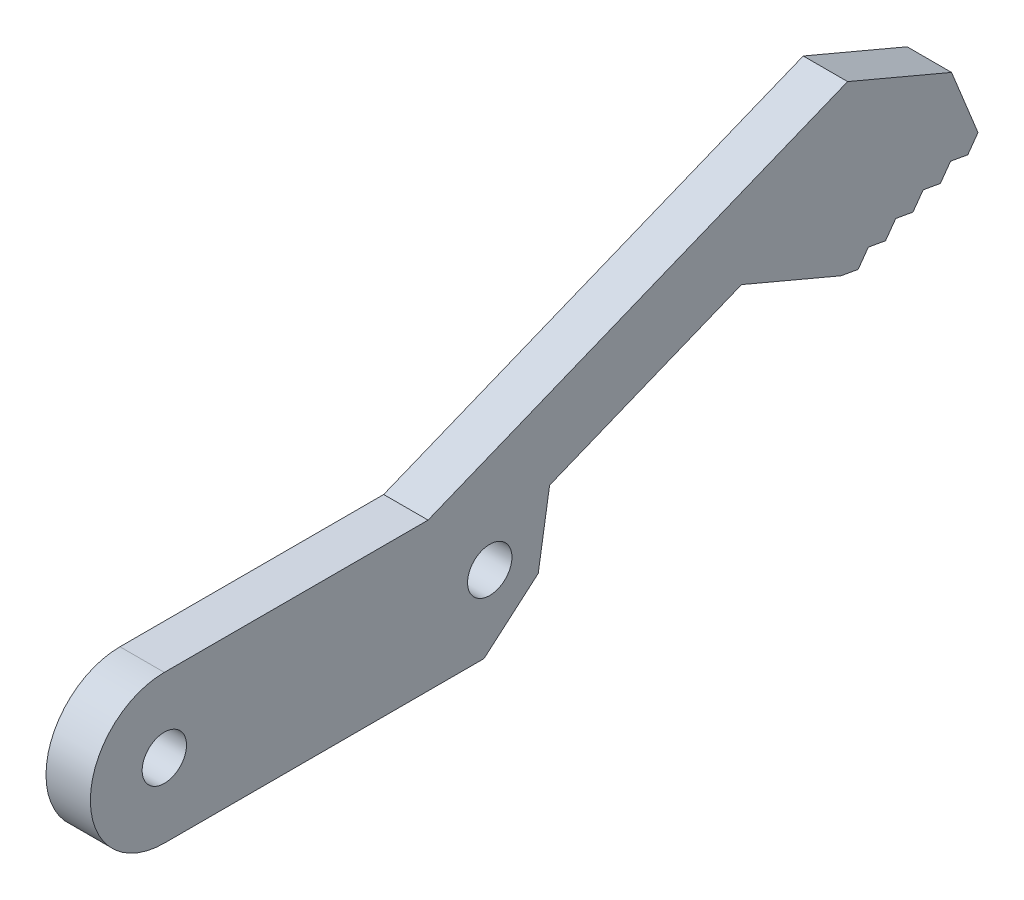
ISO-10303-21;
HEADER;
FILE_DESCRIPTION(('STEP AP214'),'2;1');
FILE_NAME('part.step','',(''),(''),'','','');
FILE_SCHEMA(('AUTOMOTIVE_DESIGN { 1 0 10303 214 1 1 1 1 }'));
ENDSEC;
DATA;
#1=APPLICATION_CONTEXT('core data for automotive mechanical design processes');
#2=APPLICATION_PROTOCOL_DEFINITION('international standard','automotive_design',2000,#1);
#3=PRODUCT_CONTEXT('',#1,'mechanical');
#4=PRODUCT('Part','Part','',(#3));
#5=PRODUCT_RELATED_PRODUCT_CATEGORY('part','',(#4));
#6=PRODUCT_DEFINITION_FORMATION('','',#4);
#7=PRODUCT_DEFINITION_CONTEXT('part definition',#1,'design');
#8=PRODUCT_DEFINITION('design','',#6,#7);
#9=PRODUCT_DEFINITION_SHAPE('','',#8);
#10=(LENGTH_UNIT() NAMED_UNIT(*) SI_UNIT(.MILLI.,.METRE.));
#11=(NAMED_UNIT(*) PLANE_ANGLE_UNIT() SI_UNIT($,.RADIAN.));
#12=(NAMED_UNIT(*) SI_UNIT($,.STERADIAN.) SOLID_ANGLE_UNIT());
#13=UNCERTAINTY_MEASURE_WITH_UNIT(LENGTH_MEASURE(1.E-05),#10,'distance_accuracy_value','');
#14=(GEOMETRIC_REPRESENTATION_CONTEXT(3) GLOBAL_UNCERTAINTY_ASSIGNED_CONTEXT((#13)) GLOBAL_UNIT_ASSIGNED_CONTEXT((#10,
#11,#12)) REPRESENTATION_CONTEXT('',''));
#15=CARTESIAN_POINT('',(0.,0.,0.));
#16=DIRECTION('',(0.,0.,1.));
#17=DIRECTION('',(1.,0.,0.));
#18=AXIS2_PLACEMENT_3D('',#15,#16,#17);
#19=CARTESIAN_POINT('',(1.5,0.,0.));
#20=DIRECTION('',(1.,0.,0.));
#21=DIRECTION('',(0.,0.,-1.));
#22=AXIS2_PLACEMENT_3D('',#19,#20,#21);
#23=PLANE('',#22);
#24=CARTESIAN_POINT('',(1.5,0.,-11.));
#25=DIRECTION('',(1.,0.,0.));
#26=DIRECTION('',(0.,0.,-1.));
#27=AXIS2_PLACEMENT_3D('',#24,#25,#26);
#28=CIRCLE('',#27,1.5);
#29=CARTESIAN_POINT('',(1.5,0.,-12.5));
#30=VERTEX_POINT('',#29);
#31=EDGE_CURVE('E116',#30,#30,#28,.T.);
#32=ORIENTED_EDGE('',*,*,#31,.F.);
#33=EDGE_LOOP('',(#32));
#34=FACE_BOUND('',#33,.T.);
#35=CARTESIAN_POINT('',(1.5,0.,11.));
#36=DIRECTION('',(1.,0.,0.));
#37=DIRECTION('',(0.,0.,-1.));
#38=AXIS2_PLACEMENT_3D('',#35,#36,#37);
#39=CIRCLE('',#38,1.5);
#40=CARTESIAN_POINT('',(1.5,0.,9.50000000000001));
#41=VERTEX_POINT('',#40);
#42=EDGE_CURVE('E87',#41,#41,#39,.T.);
#43=ORIENTED_EDGE('',*,*,#42,.F.);
#44=EDGE_LOOP('',(#43));
#45=FACE_BOUND('',#44,.T.);
#46=DIRECTION('',(0.,0.811746559900306,-0.584009865062243));
#47=VECTOR('',#46,1.);
#48=CARTESIAN_POINT('',(1.5,-17.1372740545539,-23.8200141676892));
#49=LINE('',#48,#47);
#50=CARTESIAN_POINT('',(1.5,7.39191676895877,-41.4675043211245));
#51=VERTEX_POINT('',#50);
#52=CARTESIAN_POINT('',(1.5,8.35132428291398,-42.1577486417576));
#53=VERTEX_POINT('',#52);
#54=EDGE_CURVE('E274',#51,#53,#49,.T.);
#55=ORIENTED_EDGE('',*,*,#54,.T.);
#56=DIRECTION('',(0.,-0.176310458660285,-0.984334608843456));
#57=VECTOR('',#56,1.);
#58=CARTESIAN_POINT('',(1.5,15.4081336773122,-2.7598492335221));
#59=LINE('',#58,#57);
#60=CARTESIAN_POINT('',(1.5,8.14294202768355,-43.3211388753874));
#61=VERTEX_POINT('',#60);
#62=EDGE_CURVE('E278',#53,#61,#59,.T.);
#63=ORIENTED_EDGE('',*,*,#62,.T.);
#64=DIRECTION('',(0.,0.811746559900309,-0.584009865062239));
#65=VECTOR('',#64,1.);
#66=CARTESIAN_POINT('',(1.5,-17.7598725540869,-24.6853971353918));
#67=LINE('',#66,#65);
#68=CARTESIAN_POINT('',(1.5,9.10234954163876,-44.0113831960205));
#69=VERTEX_POINT('',#68);
#70=EDGE_CURVE('E227',#61,#69,#67,.T.);
#71=ORIENTED_EDGE('',*,*,#70,.T.);
#72=DIRECTION('',(0.,0.926817277131445,0.375512629362388));
#73=VECTOR('',#72,1.);
#74=CARTESIAN_POINT('',(1.5,16.6008716845223,-40.9732549309526));
#75=LINE('',#74,#73);
#76=CARTESIAN_POINT('',(1.5,13.5184546570459,-42.2221381265287));
#77=VERTEX_POINT('',#76);
#78=EDGE_CURVE('E50',#69,#77,#75,.T.);
#79=ORIENTED_EDGE('',*,*,#78,.T.);
#80=DIRECTION('',(0.,-0.389831254937157,-0.920886308223834));
#81=VECTOR('',#80,1.);
#82=CARTESIAN_POINT('',(1.5,16.4926366310558,-35.1963201005385));
#83=LINE('',#82,#81);
#84=CARTESIAN_POINT('',(1.5,16.4926366310558,-35.1963201005385));
#85=VERTEX_POINT('',#84);
#86=EDGE_CURVE('E178',#85,#77,#83,.T.);
#87=ORIENTED_EDGE('',*,*,#86,.F.);
#88=DIRECTION('',(0.,0.375512629362387,-0.926817277131445));
#89=VECTOR('',#88,1.);
#90=CARTESIAN_POINT('',(1.5,1.91758297252369,0.776934830414033));
#91=LINE('',#90,#89);
#92=CARTESIAN_POINT('',(1.5,5.,-6.83089812380655));
#93=VERTEX_POINT('',#92);
#94=EDGE_CURVE('E161',#93,#85,#91,.T.);
#95=ORIENTED_EDGE('',*,*,#94,.F.);
#96=DIRECTION('',(0.,0.,-1.));
#97=VECTOR('',#96,1.);
#98=CARTESIAN_POINT('',(1.5,4.99999999999999,0.));
#99=LINE('',#98,#97);
#100=CARTESIAN_POINT('',(1.5,5.,11.));
#101=VERTEX_POINT('',#100);
#102=EDGE_CURVE('E102',#101,#93,#99,.T.);
#103=ORIENTED_EDGE('',*,*,#102,.F.);
#104=CARTESIAN_POINT('',(1.5,0.,11.));
#105=DIRECTION('',(1.,0.,0.));
#106=DIRECTION('',(0.,0.,-1.));
#107=AXIS2_PLACEMENT_3D('',#104,#105,#106);
#108=CIRCLE('',#107,5.);
#109=CARTESIAN_POINT('',(1.5,-5.,11.));
#110=VERTEX_POINT('',#109);
#111=EDGE_CURVE('E58',#101,#110,#108,.T.);
#112=ORIENTED_EDGE('',*,*,#111,.T.);
#113=DIRECTION('',(0.,0.,-1.));
#114=VECTOR('',#113,1.);
#115=CARTESIAN_POINT('',(1.5,-5.,0.));
#116=LINE('',#115,#114);
#117=CARTESIAN_POINT('',(1.5,-5.,-10.6103174919287));
#118=VERTEX_POINT('',#117);
#119=EDGE_CURVE('E86',#110,#118,#116,.T.);
#120=ORIENTED_EDGE('',*,*,#119,.T.);
#121=DIRECTION('',(0.,-0.652055247286905,0.758171454544164));
#122=VECTOR('',#121,1.);
#123=CARTESIAN_POINT('',(1.5,-8.11953898551642,-6.9831012092637));
#124=LINE('',#123,#122);
#125=CARTESIAN_POINT('',(1.5,-1.84405260313138,-14.2798673319224));
#126=VERTEX_POINT('',#125);
#127=EDGE_CURVE('E228',#126,#118,#124,.T.);
#128=ORIENTED_EDGE('',*,*,#127,.F.);
#129=DIRECTION('',(0.,-0.987317731643147,0.158756722008964));
#130=VECTOR('',#129,1.);
#131=CARTESIAN_POINT('',(1.5,-2.2847508524873,-14.209004825132));
#132=LINE('',#131,#130);
#133=CARTESIAN_POINT('',(1.5,2.93456521802145,-15.0482498664458));
#134=VERTEX_POINT('',#133);
#135=EDGE_CURVE('E232',#134,#126,#132,.T.);
#136=ORIENTED_EDGE('',*,*,#135,.F.);
#137=DIRECTION('',(0.,0.375512629362387,-0.926817277131445));
#138=VECTOR('',#137,1.);
#139=CARTESIAN_POINT('',(1.5,-2.71650341313353,-1.1006283163979));
#140=LINE('',#139,#138);
#141=CARTESIAN_POINT('',(1.5,8.19174202909487,-28.0236917462861));
#142=VERTEX_POINT('',#141);
#143=EDGE_CURVE('E136',#134,#142,#140,.T.);
#144=ORIENTED_EDGE('',*,*,#143,.T.);
#145=DIRECTION('',(0.,0.389831254937156,0.920886308223834));
#146=VECTOR('',#145,1.);
#147=CARTESIAN_POINT('',(1.5,17.0070885712925,-7.19947144546189));
#148=LINE('',#147,#146);
#149=CARTESIAN_POINT('',(1.5,5.34722324801488,-34.743210424706));
#150=VERTEX_POINT('',#149);
#151=EDGE_CURVE('E158',#150,#142,#148,.T.);
#152=ORIENTED_EDGE('',*,*,#151,.F.);
#153=DIRECTION('',(0.,-0.176310458660285,-0.984334608843456));
#154=VECTOR('',#153,1.);
#155=CARTESIAN_POINT('',(1.5,11.2106343735009,-2.00800832410744));
#156=LINE('',#155,#154);
#157=CARTESIAN_POINT('',(1.5,5.13884099278445,-35.9066006583358));
#158=VERTEX_POINT('',#157);
#159=EDGE_CURVE('E251',#150,#158,#156,.T.);
#160=ORIENTED_EDGE('',*,*,#159,.T.);
#161=DIRECTION('',(0.,0.811746559900309,-0.584009865062239));
#162=VECTOR('',#161,1.);
#163=CARTESIAN_POINT('',(1.5,-15.2694785559546,-21.223865264582));
#164=LINE('',#163,#162);
#165=CARTESIAN_POINT('',(1.5,6.09824850673965,-36.5968449789689));
#166=VERTEX_POINT('',#165);
#167=EDGE_CURVE('E212',#158,#166,#164,.T.);
#168=ORIENTED_EDGE('',*,*,#167,.T.);
#169=DIRECTION('',(0.,-0.176310458660285,-0.984334608843456));
#170=VECTOR('',#169,1.);
#171=CARTESIAN_POINT('',(1.5,12.2600091994537,-2.1959685514611));
#172=LINE('',#171,#170);
#173=CARTESIAN_POINT('',(1.5,5.88986625150922,-37.7602352125987));
#174=VERTEX_POINT('',#173);
#175=EDGE_CURVE('E190',#166,#174,#172,.T.);
#176=ORIENTED_EDGE('',*,*,#175,.T.);
#177=DIRECTION('',(0.,0.811746559900306,-0.584009865062243));
#178=VECTOR('',#177,1.);
#179=CARTESIAN_POINT('',(1.5,-15.8920770554877,-22.0892482322843));
#180=LINE('',#179,#178);
#181=CARTESIAN_POINT('',(1.5,6.84927376546443,-38.4504795332318));
#182=VERTEX_POINT('',#181);
#183=EDGE_CURVE('E252',#174,#182,#180,.T.);
#184=ORIENTED_EDGE('',*,*,#183,.T.);
#185=DIRECTION('',(0.,-0.176310458660286,-0.984334608843456));
#186=VECTOR('',#185,1.);
#187=CARTESIAN_POINT('',(1.5,13.3093840254066,-2.38392877881479));
#188=LINE('',#187,#186);
#189=CARTESIAN_POINT('',(1.5,6.640891510234,-39.6138697668616));
#190=VERTEX_POINT('',#189);
#191=EDGE_CURVE('E256',#182,#190,#188,.T.);
#192=ORIENTED_EDGE('',*,*,#191,.T.);
#193=DIRECTION('',(0.,0.811746559900306,-0.584009865062243));
#194=VECTOR('',#193,1.);
#195=CARTESIAN_POINT('',(1.5,-16.5146755550208,-22.9546311999867));
#196=LINE('',#195,#194);
#197=CARTESIAN_POINT('',(1.5,7.6002990241892,-40.3041140874947));
#198=VERTEX_POINT('',#197);
#199=EDGE_CURVE('E191',#190,#198,#196,.T.);
#200=ORIENTED_EDGE('',*,*,#199,.T.);
#201=DIRECTION('',(0.,-0.176310458660286,-0.984334608843456));
#202=VECTOR('',#201,1.);
#203=CARTESIAN_POINT('',(1.5,14.3587588513594,-2.57188900616846));
#204=LINE('',#203,#202);
#205=EDGE_CURVE('E195',#198,#51,#204,.T.);
#206=ORIENTED_EDGE('',*,*,#205,.T.);
#207=EDGE_LOOP('',(#55,#63,#71,#79,#87,#95,#103,#112,#120,#128,#136,#144,#152,#160,#168,#176,
#184,#192,#200,#206));
#208=FACE_BOUND('',#207,.T.);
#209=ADVANCED_FACE('F35',(#34,#45,#208),#23,.T.);
#210=CARTESIAN_POINT('',(-1.5,0.,0.));
#211=DIRECTION('',(1.,0.,0.));
#212=DIRECTION('',(0.,0.,-1.));
#213=AXIS2_PLACEMENT_3D('',#210,#211,#212);
#214=PLANE('',#213);
#215=CARTESIAN_POINT('',(-1.5,0.,-11.));
#216=DIRECTION('',(1.,0.,0.));
#217=DIRECTION('',(0.,0.,-1.));
#218=AXIS2_PLACEMENT_3D('',#215,#216,#217);
#219=CIRCLE('',#218,1.5);
#220=CARTESIAN_POINT('',(-1.5,0.,-12.5));
#221=VERTEX_POINT('',#220);
#222=EDGE_CURVE('E94',#221,#221,#219,.T.);
#223=ORIENTED_EDGE('',*,*,#222,.T.);
#224=EDGE_LOOP('',(#223));
#225=FACE_BOUND('',#224,.T.);
#226=CARTESIAN_POINT('',(-1.5,0.,11.));
#227=DIRECTION('',(1.,0.,0.));
#228=DIRECTION('',(0.,0.,-1.));
#229=AXIS2_PLACEMENT_3D('',#226,#227,#228);
#230=CIRCLE('',#229,1.5);
#231=CARTESIAN_POINT('',(-1.5,0.,9.50000000000001));
#232=VERTEX_POINT('',#231);
#233=EDGE_CURVE('E97',#232,#232,#230,.T.);
#234=ORIENTED_EDGE('',*,*,#233,.T.);
#235=EDGE_LOOP('',(#234));
#236=FACE_BOUND('',#235,.T.);
#237=DIRECTION('',(0.,-0.176310458660285,-0.984334608843456));
#238=VECTOR('',#237,1.);
#239=CARTESIAN_POINT('',(-1.5,15.4081336773122,-2.7598492335221));
#240=LINE('',#239,#238);
#241=CARTESIAN_POINT('',(-1.5,8.35132428291398,-42.1577486417576));
#242=VERTEX_POINT('',#241);
#243=CARTESIAN_POINT('',(-1.5,8.14294202768355,-43.3211388753874));
#244=VERTEX_POINT('',#243);
#245=EDGE_CURVE('E277',#242,#244,#240,.T.);
#246=ORIENTED_EDGE('',*,*,#245,.F.);
#247=DIRECTION('',(0.,0.811746559900306,-0.584009865062243));
#248=VECTOR('',#247,1.);
#249=CARTESIAN_POINT('',(-1.5,-17.1372740545539,-23.8200141676892));
#250=LINE('',#249,#248);
#251=CARTESIAN_POINT('',(-1.5,7.39191676895877,-41.4675043211245));
#252=VERTEX_POINT('',#251);
#253=EDGE_CURVE('E271',#252,#242,#250,.T.);
#254=ORIENTED_EDGE('',*,*,#253,.F.);
#255=DIRECTION('',(0.,-0.176310458660286,-0.984334608843456));
#256=VECTOR('',#255,1.);
#257=CARTESIAN_POINT('',(-1.5,14.3587588513594,-2.57188900616846));
#258=LINE('',#257,#256);
#259=CARTESIAN_POINT('',(-1.5,7.6002990241892,-40.3041140874947));
#260=VERTEX_POINT('',#259);
#261=EDGE_CURVE('E194',#260,#252,#258,.T.);
#262=ORIENTED_EDGE('',*,*,#261,.F.);
#263=DIRECTION('',(0.,0.811746559900306,-0.584009865062243));
#264=VECTOR('',#263,1.);
#265=CARTESIAN_POINT('',(-1.5,-16.5146755550208,-22.9546311999867));
#266=LINE('',#265,#264);
#267=CARTESIAN_POINT('',(-1.5,6.640891510234,-39.6138697668616));
#268=VERTEX_POINT('',#267);
#269=EDGE_CURVE('E187',#268,#260,#266,.T.);
#270=ORIENTED_EDGE('',*,*,#269,.F.);
#271=DIRECTION('',(0.,-0.176310458660286,-0.984334608843456));
#272=VECTOR('',#271,1.);
#273=CARTESIAN_POINT('',(-1.5,13.3093840254066,-2.38392877881479));
#274=LINE('',#273,#272);
#275=CARTESIAN_POINT('',(-1.5,6.84927376546443,-38.4504795332318));
#276=VERTEX_POINT('',#275);
#277=EDGE_CURVE('E255',#276,#268,#274,.T.);
#278=ORIENTED_EDGE('',*,*,#277,.F.);
#279=DIRECTION('',(0.,0.811746559900306,-0.584009865062243));
#280=VECTOR('',#279,1.);
#281=CARTESIAN_POINT('',(-1.5,-15.8920770554877,-22.0892482322843));
#282=LINE('',#281,#280);
#283=CARTESIAN_POINT('',(-1.5,5.88986625150922,-37.7602352125987));
#284=VERTEX_POINT('',#283);
#285=EDGE_CURVE('E248',#284,#276,#282,.T.);
#286=ORIENTED_EDGE('',*,*,#285,.F.);
#287=DIRECTION('',(0.,-0.176310458660285,-0.984334608843456));
#288=VECTOR('',#287,1.);
#289=CARTESIAN_POINT('',(-1.5,12.2600091994537,-2.1959685514611));
#290=LINE('',#289,#288);
#291=CARTESIAN_POINT('',(-1.5,6.09824850673965,-36.5968449789689));
#292=VERTEX_POINT('',#291);
#293=EDGE_CURVE('E215',#292,#284,#290,.T.);
#294=ORIENTED_EDGE('',*,*,#293,.F.);
#295=DIRECTION('',(0.,0.811746559900309,-0.584009865062239));
#296=VECTOR('',#295,1.);
#297=CARTESIAN_POINT('',(-1.5,-15.2694785559546,-21.223865264582));
#298=LINE('',#297,#296);
#299=CARTESIAN_POINT('',(-1.5,5.13884099278445,-35.9066006583358));
#300=VERTEX_POINT('',#299);
#301=EDGE_CURVE('E207',#300,#292,#298,.T.);
#302=ORIENTED_EDGE('',*,*,#301,.F.);
#303=DIRECTION('',(0.,-0.176310458660285,-0.984334608843456));
#304=VECTOR('',#303,1.);
#305=CARTESIAN_POINT('',(-1.5,11.2106343735009,-2.00800832410744));
#306=LINE('',#305,#304);
#307=CARTESIAN_POINT('',(-1.5,5.34722324801488,-34.743210424706));
#308=VERTEX_POINT('',#307);
#309=EDGE_CURVE('E235',#308,#300,#306,.T.);
#310=ORIENTED_EDGE('',*,*,#309,.F.);
#311=DIRECTION('',(0.,0.389831254937156,0.920886308223834));
#312=VECTOR('',#311,1.);
#313=CARTESIAN_POINT('',(-1.5,17.0070885712925,-7.19947144546189));
#314=LINE('',#313,#312);
#315=CARTESIAN_POINT('',(-1.5,8.19174202909487,-28.0236917462861));
#316=VERTEX_POINT('',#315);
#317=EDGE_CURVE('E165',#308,#316,#314,.T.);
#318=ORIENTED_EDGE('',*,*,#317,.T.);
#319=DIRECTION('',(0.,0.375512629362387,-0.926817277131445));
#320=VECTOR('',#319,1.);
#321=CARTESIAN_POINT('',(-1.5,-2.71650341313353,-1.1006283163979));
#322=LINE('',#321,#320);
#323=CARTESIAN_POINT('',(-1.5,2.93456521802145,-15.0482498664458));
#324=VERTEX_POINT('',#323);
#325=EDGE_CURVE('E144',#324,#316,#322,.T.);
#326=ORIENTED_EDGE('',*,*,#325,.F.);
#327=DIRECTION('',(0.,-0.987317731643147,0.158756722008964));
#328=VECTOR('',#327,1.);
#329=CARTESIAN_POINT('',(-1.5,-2.2847508524873,-14.209004825132));
#330=LINE('',#329,#328);
#331=CARTESIAN_POINT('',(-1.5,-1.84405260313138,-14.2798673319224));
#332=VERTEX_POINT('',#331);
#333=EDGE_CURVE('E231',#324,#332,#330,.T.);
#334=ORIENTED_EDGE('',*,*,#333,.T.);
#335=DIRECTION('',(0.,-0.652055247286905,0.758171454544164));
#336=VECTOR('',#335,1.);
#337=CARTESIAN_POINT('',(-1.5,-8.11953898551642,-6.9831012092637));
#338=LINE('',#337,#336);
#339=CARTESIAN_POINT('',(-1.5,-5.,-10.6103174919287));
#340=VERTEX_POINT('',#339);
#341=EDGE_CURVE('E93',#332,#340,#338,.T.);
#342=ORIENTED_EDGE('',*,*,#341,.T.);
#343=DIRECTION('',(0.,0.,-1.));
#344=VECTOR('',#343,1.);
#345=CARTESIAN_POINT('',(-1.5,-5.,0.));
#346=LINE('',#345,#344);
#347=CARTESIAN_POINT('',(-1.5,-5.,11.));
#348=VERTEX_POINT('',#347);
#349=EDGE_CURVE('E78',#348,#340,#346,.T.);
#350=ORIENTED_EDGE('',*,*,#349,.F.);
#351=CARTESIAN_POINT('',(-1.5,0.,11.));
#352=DIRECTION('',(1.,0.,0.));
#353=DIRECTION('',(0.,0.,-1.));
#354=AXIS2_PLACEMENT_3D('',#351,#352,#353);
#355=CIRCLE('',#354,5.);
#356=CARTESIAN_POINT('',(-1.5,5.,11.));
#357=VERTEX_POINT('',#356);
#358=EDGE_CURVE('E70',#357,#348,#355,.T.);
#359=ORIENTED_EDGE('',*,*,#358,.F.);
#360=DIRECTION('',(0.,0.,-1.));
#361=VECTOR('',#360,1.);
#362=CARTESIAN_POINT('',(-1.5,4.99999999999999,0.));
#363=LINE('',#362,#361);
#364=CARTESIAN_POINT('',(-1.5,5.,-6.83089812380655));
#365=VERTEX_POINT('',#364);
#366=EDGE_CURVE('E79',#357,#365,#363,.T.);
#367=ORIENTED_EDGE('',*,*,#366,.T.);
#368=DIRECTION('',(0.,0.375512629362387,-0.926817277131445));
#369=VECTOR('',#368,1.);
#370=CARTESIAN_POINT('',(-1.5,1.91758297252369,0.776934830414033));
#371=LINE('',#370,#369);
#372=CARTESIAN_POINT('',(-1.5,16.4926366310558,-35.1963201005385));
#373=VERTEX_POINT('',#372);
#374=EDGE_CURVE('E150',#365,#373,#371,.T.);
#375=ORIENTED_EDGE('',*,*,#374,.T.);
#376=DIRECTION('',(0.,-0.389831254937157,-0.920886308223834));
#377=VECTOR('',#376,1.);
#378=CARTESIAN_POINT('',(-1.5,16.4926366310558,-35.1963201005385));
#379=LINE('',#378,#377);
#380=CARTESIAN_POINT('',(-1.5,13.5184546570459,-42.2221381265287));
#381=VERTEX_POINT('',#380);
#382=EDGE_CURVE('E175',#373,#381,#379,.T.);
#383=ORIENTED_EDGE('',*,*,#382,.T.);
#384=DIRECTION('',(0.,0.926817277131445,0.375512629362388));
#385=VECTOR('',#384,1.);
#386=CARTESIAN_POINT('',(-1.5,16.6008716845223,-40.9732549309526));
#387=LINE('',#386,#385);
#388=CARTESIAN_POINT('',(-1.5,9.10234954163876,-44.0113831960205));
#389=VERTEX_POINT('',#388);
#390=EDGE_CURVE('E154',#389,#381,#387,.T.);
#391=ORIENTED_EDGE('',*,*,#390,.F.);
#392=DIRECTION('',(0.,0.811746559900309,-0.584009865062239));
#393=VECTOR('',#392,1.);
#394=CARTESIAN_POINT('',(-1.5,-17.7598725540869,-24.6853971353918));
#395=LINE('',#394,#393);
#396=EDGE_CURVE('E240',#244,#389,#395,.T.);
#397=ORIENTED_EDGE('',*,*,#396,.F.);
#398=EDGE_LOOP('',(#246,#254,#262,#270,#278,#286,#294,#302,#310,#318,#326,#334,#342,#350,#359,
#367,#375,#383,#391,#397));
#399=FACE_BOUND('',#398,.T.);
#400=ADVANCED_FACE('F90',(#225,#236,#399),#214,.F.);
#401=CARTESIAN_POINT('',(-1.5,16.6008716845223,-40.9732549309526));
#402=DIRECTION('',(0.,0.375512629362387,-0.926817277131445));
#403=DIRECTION('',(0.,0.926817277131445,0.375512629362388));
#404=AXIS2_PLACEMENT_3D('',#401,#402,#403);
#405=PLANE('',#404);
#406=ORIENTED_EDGE('',*,*,#78,.F.);
#407=DIRECTION('',(1.,0.,0.));
#408=VECTOR('',#407,1.);
#409=CARTESIAN_POINT('',(-1.5,9.10234954163876,-44.0113831960205));
#410=LINE('',#409,#408);
#411=EDGE_CURVE('E198',#389,#69,#410,.T.);
#412=ORIENTED_EDGE('',*,*,#411,.F.);
#413=ORIENTED_EDGE('',*,*,#390,.T.);
#414=DIRECTION('',(1.,0.,0.));
#415=VECTOR('',#414,1.);
#416=CARTESIAN_POINT('',(-1.5,13.5184546570459,-42.2221381265287));
#417=LINE('',#416,#415);
#418=EDGE_CURVE('E160',#381,#77,#417,.T.);
#419=ORIENTED_EDGE('',*,*,#418,.T.);
#420=EDGE_LOOP('',(#406,#412,#413,#419));
#421=FACE_BOUND('',#420,.T.);
#422=ADVANCED_FACE('F308',(#421),#405,.T.);
#423=CARTESIAN_POINT('',(1.5,4.99999999999999,0.));
#424=DIRECTION('',(0.,1.,0.));
#425=DIRECTION('',(0.,0.,1.));
#426=AXIS2_PLACEMENT_3D('',#423,#424,#425);
#427=PLANE('',#426);
#428=ORIENTED_EDGE('',*,*,#102,.T.);
#429=DIRECTION('',(1.,0.,0.));
#430=VECTOR('',#429,1.);
#431=CARTESIAN_POINT('',(-1.5,5.,-6.83089812380655));
#432=LINE('',#431,#430);
#433=EDGE_CURVE('E133',#365,#93,#432,.T.);
#434=ORIENTED_EDGE('',*,*,#433,.F.);
#435=ORIENTED_EDGE('',*,*,#366,.F.);
#436=DIRECTION('',(-1.,0.,0.));
#437=VECTOR('',#436,1.);
#438=CARTESIAN_POINT('',(1.5,5.,11.));
#439=LINE('',#438,#437);
#440=EDGE_CURVE('E12',#101,#357,#439,.T.);
#441=ORIENTED_EDGE('',*,*,#440,.F.);
#442=EDGE_LOOP('',(#428,#434,#435,#441));
#443=FACE_BOUND('',#442,.T.);
#444=ADVANCED_FACE('F37',(#443),#427,.T.);
#445=CARTESIAN_POINT('',(1.5,0.,11.));
#446=DIRECTION('',(-1.,0.,0.));
#447=DIRECTION('',(0.,0.,1.));
#448=AXIS2_PLACEMENT_3D('',#445,#446,#447);
#449=CYLINDRICAL_SURFACE('',#448,5.);
#450=ORIENTED_EDGE('',*,*,#358,.T.);
#451=DIRECTION('',(-1.,0.,0.));
#452=VECTOR('',#451,1.);
#453=CARTESIAN_POINT('',(1.5,-5.,11.));
#454=LINE('',#453,#452);
#455=EDGE_CURVE('E43',#110,#348,#454,.T.);
#456=ORIENTED_EDGE('',*,*,#455,.F.);
#457=ORIENTED_EDGE('',*,*,#111,.F.);
#458=ORIENTED_EDGE('',*,*,#440,.T.);
#459=EDGE_LOOP('',(#450,#456,#457,#458));
#460=FACE_BOUND('',#459,.T.);
#461=ADVANCED_FACE('F72',(#460),#449,.T.);
#462=CARTESIAN_POINT('',(1.5,-5.,0.));
#463=DIRECTION('',(0.,1.,0.));
#464=DIRECTION('',(0.,0.,1.));
#465=AXIS2_PLACEMENT_3D('',#462,#463,#464);
#466=PLANE('',#465);
#467=ORIENTED_EDGE('',*,*,#349,.T.);
#468=DIRECTION('',(1.,0.,0.));
#469=VECTOR('',#468,1.);
#470=CARTESIAN_POINT('',(-1.5,-5.,-10.6103174919287));
#471=LINE('',#470,#469);
#472=EDGE_CURVE('E225',#340,#118,#471,.T.);
#473=ORIENTED_EDGE('',*,*,#472,.T.);
#474=ORIENTED_EDGE('',*,*,#119,.F.);
#475=ORIENTED_EDGE('',*,*,#455,.T.);
#476=EDGE_LOOP('',(#467,#473,#474,#475));
#477=FACE_BOUND('',#476,.T.);
#478=ADVANCED_FACE('F83',(#477),#466,.F.);
#479=CARTESIAN_POINT('',(1.5,0.,-11.));
#480=DIRECTION('',(-1.,0.,0.));
#481=DIRECTION('',(0.,0.,1.));
#482=AXIS2_PLACEMENT_3D('',#479,#480,#481);
#483=CYLINDRICAL_SURFACE('',#482,1.5);
#484=ORIENTED_EDGE('',*,*,#31,.T.);
#485=EDGE_LOOP('',(#484));
#486=FACE_BOUND('',#485,.T.);
#487=ORIENTED_EDGE('',*,*,#222,.F.);
#488=EDGE_LOOP('',(#487));
#489=FACE_BOUND('',#488,.T.);
#490=ADVANCED_FACE('F428',(#486,#489),#483,.F.);
#491=CARTESIAN_POINT('',(1.5,0.,11.));
#492=DIRECTION('',(-1.,0.,0.));
#493=DIRECTION('',(0.,0.,1.));
#494=AXIS2_PLACEMENT_3D('',#491,#492,#493);
#495=CYLINDRICAL_SURFACE('',#494,1.5);
#496=ORIENTED_EDGE('',*,*,#42,.T.);
#497=EDGE_LOOP('',(#496));
#498=FACE_BOUND('',#497,.T.);
#499=ORIENTED_EDGE('',*,*,#233,.F.);
#500=EDGE_LOOP('',(#499));
#501=FACE_BOUND('',#500,.T.);
#502=ADVANCED_FACE('F425',(#498,#501),#495,.F.);
#503=CARTESIAN_POINT('',(-1.5,17.0070885712925,-7.19947144546189));
#504=DIRECTION('',(0.,0.920886308223834,-0.389831254937156));
#505=DIRECTION('',(0.,0.389831254937156,0.920886308223834));
#506=AXIS2_PLACEMENT_3D('',#503,#504,#505);
#507=PLANE('',#506);
#508=ORIENTED_EDGE('',*,*,#151,.T.);
#509=DIRECTION('',(1.,0.,0.));
#510=VECTOR('',#509,1.);
#511=CARTESIAN_POINT('',(-1.5,8.19174202909487,-28.0236917462861));
#512=LINE('',#511,#510);
#513=EDGE_CURVE('E120',#316,#142,#512,.T.);
#514=ORIENTED_EDGE('',*,*,#513,.F.);
#515=ORIENTED_EDGE('',*,*,#317,.F.);
#516=DIRECTION('',(1.,0.,0.));
#517=VECTOR('',#516,1.);
#518=CARTESIAN_POINT('',(-1.5,5.34722324801488,-34.743210424706));
#519=LINE('',#518,#517);
#520=EDGE_CURVE('E112',#308,#150,#519,.T.);
#521=ORIENTED_EDGE('',*,*,#520,.T.);
#522=EDGE_LOOP('',(#508,#514,#515,#521));
#523=FACE_BOUND('',#522,.T.);
#524=ADVANCED_FACE('F401',(#523),#507,.F.);
#525=CARTESIAN_POINT('',(-1.5,-2.71650341313353,-1.1006283163979));
#526=DIRECTION('',(0.,-0.926817277131445,-0.375512629362387));
#527=DIRECTION('',(0.,0.375512629362387,-0.926817277131445));
#528=AXIS2_PLACEMENT_3D('',#525,#526,#527);
#529=PLANE('',#528);
#530=ORIENTED_EDGE('',*,*,#143,.F.);
#531=DIRECTION('',(1.,0.,0.));
#532=VECTOR('',#531,1.);
#533=CARTESIAN_POINT('',(-1.5,2.93456521802145,-15.0482498664458));
#534=LINE('',#533,#532);
#535=EDGE_CURVE('E124',#324,#134,#534,.T.);
#536=ORIENTED_EDGE('',*,*,#535,.F.);
#537=ORIENTED_EDGE('',*,*,#325,.T.);
#538=ORIENTED_EDGE('',*,*,#513,.T.);
#539=EDGE_LOOP('',(#530,#536,#537,#538));
#540=FACE_BOUND('',#539,.T.);
#541=ADVANCED_FACE('F329',(#540),#529,.T.);
#542=CARTESIAN_POINT('',(-1.5,1.91758297252369,0.776934830414033));
#543=DIRECTION('',(0.,-0.926817277131445,-0.375512629362387));
#544=DIRECTION('',(0.,0.375512629362387,-0.926817277131445));
#545=AXIS2_PLACEMENT_3D('',#542,#543,#544);
#546=PLANE('',#545);
#547=ORIENTED_EDGE('',*,*,#94,.T.);
#548=DIRECTION('',(1.,0.,0.));
#549=VECTOR('',#548,1.);
#550=CARTESIAN_POINT('',(-1.5,16.4926366310558,-35.1963201005385));
#551=LINE('',#550,#549);
#552=EDGE_CURVE('E172',#373,#85,#551,.T.);
#553=ORIENTED_EDGE('',*,*,#552,.F.);
#554=ORIENTED_EDGE('',*,*,#374,.F.);
#555=ORIENTED_EDGE('',*,*,#433,.T.);
#556=EDGE_LOOP('',(#547,#553,#554,#555));
#557=FACE_BOUND('',#556,.T.);
#558=ADVANCED_FACE('F444',(#557),#546,.F.);
#559=CARTESIAN_POINT('',(-1.5,16.4926366310558,-35.1963201005385));
#560=DIRECTION('',(0.,-0.920886308223833,0.389831254937157));
#561=DIRECTION('',(0.,-0.389831254937157,-0.920886308223834));
#562=AXIS2_PLACEMENT_3D('',#559,#560,#561);
#563=PLANE('',#562);
#564=ORIENTED_EDGE('',*,*,#86,.T.);
#565=ORIENTED_EDGE('',*,*,#418,.F.);
#566=ORIENTED_EDGE('',*,*,#382,.F.);
#567=ORIENTED_EDGE('',*,*,#552,.T.);
#568=EDGE_LOOP('',(#564,#565,#566,#567));
#569=FACE_BOUND('',#568,.T.);
#570=ADVANCED_FACE('F312',(#569),#563,.F.);
#571=CARTESIAN_POINT('',(-1.5,12.2600091994537,-2.1959685514611));
#572=DIRECTION('',(0.,-0.984334608843456,0.176310458660285));
#573=DIRECTION('',(0.,-0.176310458660285,-0.984334608843456));
#574=AXIS2_PLACEMENT_3D('',#571,#572,#573);
#575=PLANE('',#574);
#576=ORIENTED_EDGE('',*,*,#175,.F.);
#577=DIRECTION('',(1.,0.,0.));
#578=VECTOR('',#577,1.);
#579=CARTESIAN_POINT('',(-1.5,6.09824850673965,-36.5968449789689));
#580=LINE('',#579,#578);
#581=EDGE_CURVE('E203',#292,#166,#580,.T.);
#582=ORIENTED_EDGE('',*,*,#581,.F.);
#583=ORIENTED_EDGE('',*,*,#293,.T.);
#584=DIRECTION('',(1.,0.,0.));
#585=VECTOR('',#584,1.);
#586=CARTESIAN_POINT('',(-1.5,5.88986625150922,-37.7602352125987));
#587=LINE('',#586,#585);
#588=EDGE_CURVE('E180',#284,#174,#587,.T.);
#589=ORIENTED_EDGE('',*,*,#588,.T.);
#590=EDGE_LOOP('',(#576,#582,#583,#589));
#591=FACE_BOUND('',#590,.T.);
#592=ADVANCED_FACE('F396',(#591),#575,.T.);
#593=CARTESIAN_POINT('',(-1.5,-15.2694785559546,-21.223865264582));
#594=DIRECTION('',(0.,-0.584009865062239,-0.811746559900309));
#595=DIRECTION('',(0.,0.811746559900309,-0.584009865062239));
#596=AXIS2_PLACEMENT_3D('',#593,#594,#595);
#597=PLANE('',#596);
#598=ORIENTED_EDGE('',*,*,#167,.F.);
#599=DIRECTION('',(1.,0.,0.));
#600=VECTOR('',#599,1.);
#601=CARTESIAN_POINT('',(-1.5,5.13884099278445,-35.9066006583358));
#602=LINE('',#601,#600);
#603=EDGE_CURVE('E206',#300,#158,#602,.T.);
#604=ORIENTED_EDGE('',*,*,#603,.F.);
#605=ORIENTED_EDGE('',*,*,#301,.T.);
#606=ORIENTED_EDGE('',*,*,#581,.T.);
#607=EDGE_LOOP('',(#598,#604,#605,#606));
#608=FACE_BOUND('',#607,.T.);
#609=ADVANCED_FACE('F399',(#608),#597,.T.);
#610=CARTESIAN_POINT('',(-1.5,14.3587588513594,-2.57188900616846));
#611=DIRECTION('',(0.,-0.984334608843456,0.176310458660286));
#612=DIRECTION('',(0.,-0.176310458660286,-0.984334608843456));
#613=AXIS2_PLACEMENT_3D('',#610,#611,#612);
#614=PLANE('',#613);
#615=ORIENTED_EDGE('',*,*,#205,.F.);
#616=DIRECTION('',(1.,0.,0.));
#617=VECTOR('',#616,1.);
#618=CARTESIAN_POINT('',(-1.5,7.6002990241892,-40.3041140874947));
#619=LINE('',#618,#617);
#620=EDGE_CURVE('E183',#260,#198,#619,.T.);
#621=ORIENTED_EDGE('',*,*,#620,.F.);
#622=ORIENTED_EDGE('',*,*,#261,.T.);
#623=DIRECTION('',(1.,0.,0.));
#624=VECTOR('',#623,1.);
#625=CARTESIAN_POINT('',(-1.5,7.39191676895877,-41.4675043211245));
#626=LINE('',#625,#624);
#627=EDGE_CURVE('E186',#252,#51,#626,.T.);
#628=ORIENTED_EDGE('',*,*,#627,.T.);
#629=EDGE_LOOP('',(#615,#621,#622,#628));
#630=FACE_BOUND('',#629,.T.);
#631=ADVANCED_FACE('F354',(#630),#614,.T.);
#632=CARTESIAN_POINT('',(-1.5,-16.5146755550208,-22.9546311999867));
#633=DIRECTION('',(0.,-0.584009865062243,-0.811746559900306));
#634=DIRECTION('',(0.,0.811746559900306,-0.584009865062243));
#635=AXIS2_PLACEMENT_3D('',#632,#633,#634);
#636=PLANE('',#635);
#637=ORIENTED_EDGE('',*,*,#199,.F.);
#638=DIRECTION('',(1.,0.,0.));
#639=VECTOR('',#638,1.);
#640=CARTESIAN_POINT('',(-1.5,6.640891510234,-39.6138697668616));
#641=LINE('',#640,#639);
#642=EDGE_CURVE('E247',#268,#190,#641,.T.);
#643=ORIENTED_EDGE('',*,*,#642,.F.);
#644=ORIENTED_EDGE('',*,*,#269,.T.);
#645=ORIENTED_EDGE('',*,*,#620,.T.);
#646=EDGE_LOOP('',(#637,#643,#644,#645));
#647=FACE_BOUND('',#646,.T.);
#648=ADVANCED_FACE('F348',(#647),#636,.T.);
#649=CARTESIAN_POINT('',(-1.5,-17.7598725540869,-24.6853971353918));
#650=DIRECTION('',(0.,-0.584009865062239,-0.811746559900309));
#651=DIRECTION('',(0.,0.811746559900309,-0.584009865062239));
#652=AXIS2_PLACEMENT_3D('',#649,#650,#651);
#653=PLANE('',#652);
#654=ORIENTED_EDGE('',*,*,#70,.F.);
#655=DIRECTION('',(1.,0.,0.));
#656=VECTOR('',#655,1.);
#657=CARTESIAN_POINT('',(-1.5,8.14294202768355,-43.3211388753874));
#658=LINE('',#657,#656);
#659=EDGE_CURVE('E259',#244,#61,#658,.T.);
#660=ORIENTED_EDGE('',*,*,#659,.F.);
#661=ORIENTED_EDGE('',*,*,#396,.T.);
#662=ORIENTED_EDGE('',*,*,#411,.T.);
#663=EDGE_LOOP('',(#654,#660,#661,#662));
#664=FACE_BOUND('',#663,.T.);
#665=ADVANCED_FACE('F299',(#664),#653,.T.);
#666=CARTESIAN_POINT('',(-1.5,-2.2847508524873,-14.209004825132));
#667=DIRECTION('',(0.,0.158756722008964,0.987317731643147));
#668=DIRECTION('',(0.,-0.987317731643147,0.158756722008964));
#669=AXIS2_PLACEMENT_3D('',#666,#667,#668);
#670=PLANE('',#669);
#671=ORIENTED_EDGE('',*,*,#135,.T.);
#672=DIRECTION('',(1.,0.,0.));
#673=VECTOR('',#672,1.);
#674=CARTESIAN_POINT('',(-1.5,-1.84405260313138,-14.2798673319224));
#675=LINE('',#674,#673);
#676=EDGE_CURVE('E222',#332,#126,#675,.T.);
#677=ORIENTED_EDGE('',*,*,#676,.F.);
#678=ORIENTED_EDGE('',*,*,#333,.F.);
#679=ORIENTED_EDGE('',*,*,#535,.T.);
#680=EDGE_LOOP('',(#671,#677,#678,#679));
#681=FACE_BOUND('',#680,.T.);
#682=ADVANCED_FACE('F326',(#681),#670,.F.);
#683=CARTESIAN_POINT('',(-1.5,-8.11953898551642,-6.9831012092637));
#684=DIRECTION('',(0.,0.758171454544164,0.652055247286905));
#685=DIRECTION('',(0.,-0.652055247286905,0.758171454544164));
#686=AXIS2_PLACEMENT_3D('',#683,#684,#685);
#687=PLANE('',#686);
#688=ORIENTED_EDGE('',*,*,#127,.T.);
#689=ORIENTED_EDGE('',*,*,#472,.F.);
#690=ORIENTED_EDGE('',*,*,#341,.F.);
#691=ORIENTED_EDGE('',*,*,#676,.T.);
#692=EDGE_LOOP('',(#688,#689,#690,#691));
#693=FACE_BOUND('',#692,.T.);
#694=ADVANCED_FACE('F461',(#693),#687,.F.);
#695=CARTESIAN_POINT('',(-1.5,13.3093840254066,-2.38392877881479));
#696=DIRECTION('',(0.,-0.984334608843456,0.176310458660286));
#697=DIRECTION('',(0.,-0.176310458660286,-0.984334608843456));
#698=AXIS2_PLACEMENT_3D('',#695,#696,#697);
#699=PLANE('',#698);
#700=ORIENTED_EDGE('',*,*,#191,.F.);
#701=DIRECTION('',(1.,0.,0.));
#702=VECTOR('',#701,1.);
#703=CARTESIAN_POINT('',(-1.5,6.84927376546443,-38.4504795332318));
#704=LINE('',#703,#702);
#705=EDGE_CURVE('E244',#276,#182,#704,.T.);
#706=ORIENTED_EDGE('',*,*,#705,.F.);
#707=ORIENTED_EDGE('',*,*,#277,.T.);
#708=ORIENTED_EDGE('',*,*,#642,.T.);
#709=EDGE_LOOP('',(#700,#706,#707,#708));
#710=FACE_BOUND('',#709,.T.);
#711=ADVANCED_FACE('F365',(#710),#699,.T.);
#712=CARTESIAN_POINT('',(-1.5,-15.8920770554877,-22.0892482322843));
#713=DIRECTION('',(0.,-0.584009865062243,-0.811746559900306));
#714=DIRECTION('',(0.,0.811746559900306,-0.584009865062243));
#715=AXIS2_PLACEMENT_3D('',#712,#713,#714);
#716=PLANE('',#715);
#717=ORIENTED_EDGE('',*,*,#183,.F.);
#718=ORIENTED_EDGE('',*,*,#588,.F.);
#719=ORIENTED_EDGE('',*,*,#285,.T.);
#720=ORIENTED_EDGE('',*,*,#705,.T.);
#721=EDGE_LOOP('',(#717,#718,#719,#720));
#722=FACE_BOUND('',#721,.T.);
#723=ADVANCED_FACE('F390',(#722),#716,.T.);
#724=CARTESIAN_POINT('',(-1.5,11.2106343735009,-2.00800832410744));
#725=DIRECTION('',(0.,-0.984334608843456,0.176310458660285));
#726=DIRECTION('',(0.,-0.176310458660285,-0.984334608843456));
#727=AXIS2_PLACEMENT_3D('',#724,#725,#726);
#728=PLANE('',#727);
#729=ORIENTED_EDGE('',*,*,#159,.F.);
#730=ORIENTED_EDGE('',*,*,#520,.F.);
#731=ORIENTED_EDGE('',*,*,#309,.T.);
#732=ORIENTED_EDGE('',*,*,#603,.T.);
#733=EDGE_LOOP('',(#729,#730,#731,#732));
#734=FACE_BOUND('',#733,.T.);
#735=ADVANCED_FACE('F402',(#734),#728,.T.);
#736=CARTESIAN_POINT('',(-1.5,15.4081336773122,-2.7598492335221));
#737=DIRECTION('',(0.,-0.984334608843456,0.176310458660285));
#738=DIRECTION('',(0.,-0.176310458660285,-0.984334608843456));
#739=AXIS2_PLACEMENT_3D('',#736,#737,#738);
#740=PLANE('',#739);
#741=ORIENTED_EDGE('',*,*,#62,.F.);
#742=DIRECTION('',(1.,0.,0.));
#743=VECTOR('',#742,1.);
#744=CARTESIAN_POINT('',(-1.5,8.35132428291398,-42.1577486417576));
#745=LINE('',#744,#743);
#746=EDGE_CURVE('E268',#242,#53,#745,.T.);
#747=ORIENTED_EDGE('',*,*,#746,.F.);
#748=ORIENTED_EDGE('',*,*,#245,.T.);
#749=ORIENTED_EDGE('',*,*,#659,.T.);
#750=EDGE_LOOP('',(#741,#747,#748,#749));
#751=FACE_BOUND('',#750,.T.);
#752=ADVANCED_FACE('F289',(#751),#740,.T.);
#753=CARTESIAN_POINT('',(-1.5,-17.1372740545539,-23.8200141676892));
#754=DIRECTION('',(0.,-0.584009865062243,-0.811746559900306));
#755=DIRECTION('',(0.,0.811746559900306,-0.584009865062243));
#756=AXIS2_PLACEMENT_3D('',#753,#754,#755);
#757=PLANE('',#756);
#758=ORIENTED_EDGE('',*,*,#54,.F.);
#759=ORIENTED_EDGE('',*,*,#627,.F.);
#760=ORIENTED_EDGE('',*,*,#253,.T.);
#761=ORIENTED_EDGE('',*,*,#746,.T.);
#762=EDGE_LOOP('',(#758,#759,#760,#761));
#763=FACE_BOUND('',#762,.T.);
#764=ADVANCED_FACE('F409',(#763),#757,.T.);
#765=CLOSED_SHELL('',(#209,#400,#422,#444,#461,#478,#490,#502,#524,#541,#558,#570,#592,#609,
#631,#648,#665,#682,#694,#711,#723,#735,#752,#764));
#766=MANIFOLD_SOLID_BREP('B2',#765);
#767=ADVANCED_BREP_SHAPE_REPRESENTATION('',(#18,#766),#14);
#768=SHAPE_DEFINITION_REPRESENTATION(#9,#767);
ENDSEC;
END-ISO-10303-21;
